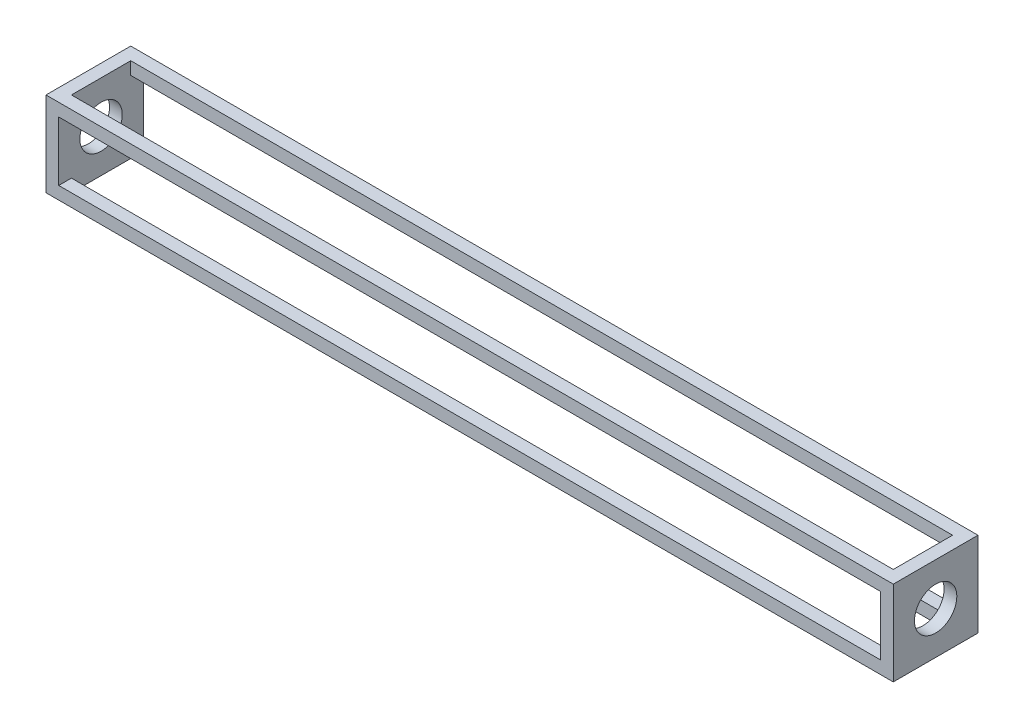
ISO-10303-21;
HEADER;
FILE_DESCRIPTION(('STEP AP214'),'2;1');
FILE_NAME('part.step','',(''),(''),'','','');
FILE_SCHEMA(('AUTOMOTIVE_DESIGN { 1 0 10303 214 1 1 1 1 }'));
ENDSEC;
DATA;
#1=APPLICATION_CONTEXT('core data for automotive mechanical design processes');
#2=APPLICATION_PROTOCOL_DEFINITION('international standard','automotive_design',2000,#1);
#3=PRODUCT_CONTEXT('',#1,'mechanical');
#4=PRODUCT('Part','Part','',(#3));
#5=PRODUCT_RELATED_PRODUCT_CATEGORY('part','',(#4));
#6=PRODUCT_DEFINITION_FORMATION('','',#4);
#7=PRODUCT_DEFINITION_CONTEXT('part definition',#1,'design');
#8=PRODUCT_DEFINITION('design','',#6,#7);
#9=PRODUCT_DEFINITION_SHAPE('','',#8);
#10=(LENGTH_UNIT() NAMED_UNIT(*) SI_UNIT(.MILLI.,.METRE.));
#11=(NAMED_UNIT(*) PLANE_ANGLE_UNIT() SI_UNIT($,.RADIAN.));
#12=(NAMED_UNIT(*) SI_UNIT($,.STERADIAN.) SOLID_ANGLE_UNIT());
#13=UNCERTAINTY_MEASURE_WITH_UNIT(LENGTH_MEASURE(1.E-05),#10,'distance_accuracy_value','');
#14=(GEOMETRIC_REPRESENTATION_CONTEXT(3) GLOBAL_UNCERTAINTY_ASSIGNED_CONTEXT((#13)) GLOBAL_UNIT_ASSIGNED_CONTEXT((#10,
#11,#12)) REPRESENTATION_CONTEXT('',''));
#15=CARTESIAN_POINT('',(0.,0.,0.));
#16=DIRECTION('',(0.,0.,1.));
#17=DIRECTION('',(1.,0.,0.));
#18=AXIS2_PLACEMENT_3D('',#15,#16,#17);
#19=CARTESIAN_POINT('',(0.,3.,20.));
#20=DIRECTION('',(0.,1.,0.));
#21=DIRECTION('',(0.,0.,1.));
#22=AXIS2_PLACEMENT_3D('',#19,#20,#21);
#23=PLANE('',#22);
#24=DIRECTION('',(1.,0.,0.));
#25=VECTOR('',#24,1.);
#26=CARTESIAN_POINT('',(0.,3.,17.));
#27=LINE('',#26,#25);
#28=CARTESIAN_POINT('',(3.,3.,17.));
#29=VERTEX_POINT('',#28);
#30=CARTESIAN_POINT('',(197.,3.,17.));
#31=VERTEX_POINT('',#30);
#32=EDGE_CURVE('E237',#29,#31,#27,.T.);
#33=ORIENTED_EDGE('',*,*,#32,.F.);
#34=DIRECTION('',(0.,0.,-1.));
#35=VECTOR('',#34,1.);
#36=CARTESIAN_POINT('',(3.,3.,20.));
#37=LINE('',#36,#35);
#38=CARTESIAN_POINT('',(3.,3.,20.));
#39=VERTEX_POINT('',#38);
#40=EDGE_CURVE('E175',#39,#29,#37,.T.);
#41=ORIENTED_EDGE('',*,*,#40,.F.);
#42=DIRECTION('',(1.,0.,0.));
#43=VECTOR('',#42,1.);
#44=CARTESIAN_POINT('',(3.,3.,20.));
#45=LINE('',#44,#43);
#46=CARTESIAN_POINT('',(197.,3.,20.));
#47=VERTEX_POINT('',#46);
#48=EDGE_CURVE('E225',#39,#47,#45,.T.);
#49=ORIENTED_EDGE('',*,*,#48,.T.);
#50=DIRECTION('',(0.,0.,-1.));
#51=VECTOR('',#50,1.);
#52=CARTESIAN_POINT('',(197.,3.,20.));
#53=LINE('',#52,#51);
#54=EDGE_CURVE('E179',#47,#31,#53,.T.);
#55=ORIENTED_EDGE('',*,*,#54,.T.);
#56=EDGE_LOOP('',(#33,#41,#49,#55));
#57=FACE_BOUND('',#56,.T.);
#58=ADVANCED_FACE('F16',(#57),#23,.T.);
#59=CARTESIAN_POINT('',(0.,17.,20.));
#60=DIRECTION('',(0.,-1.,0.));
#61=DIRECTION('',(0.,0.,-1.));
#62=AXIS2_PLACEMENT_3D('',#59,#60,#61);
#63=PLANE('',#62);
#64=DIRECTION('',(-1.,0.,0.));
#65=VECTOR('',#64,1.);
#66=CARTESIAN_POINT('',(0.,17.,17.));
#67=LINE('',#66,#65);
#68=CARTESIAN_POINT('',(197.,17.,17.));
#69=VERTEX_POINT('',#68);
#70=CARTESIAN_POINT('',(3.,17.,17.));
#71=VERTEX_POINT('',#70);
#72=EDGE_CURVE('E239',#69,#71,#67,.T.);
#73=ORIENTED_EDGE('',*,*,#72,.F.);
#74=DIRECTION('',(0.,0.,-1.));
#75=VECTOR('',#74,1.);
#76=CARTESIAN_POINT('',(197.,17.,20.));
#77=LINE('',#76,#75);
#78=CARTESIAN_POINT('',(197.,17.,20.));
#79=VERTEX_POINT('',#78);
#80=EDGE_CURVE('E165',#79,#69,#77,.T.);
#81=ORIENTED_EDGE('',*,*,#80,.F.);
#82=DIRECTION('',(-1.,0.,0.));
#83=VECTOR('',#82,1.);
#84=CARTESIAN_POINT('',(197.,17.,20.));
#85=LINE('',#84,#83);
#86=CARTESIAN_POINT('',(3.,17.,20.));
#87=VERTEX_POINT('',#86);
#88=EDGE_CURVE('E231',#79,#87,#85,.T.);
#89=ORIENTED_EDGE('',*,*,#88,.T.);
#90=DIRECTION('',(0.,0.,-1.));
#91=VECTOR('',#90,1.);
#92=CARTESIAN_POINT('',(3.,17.,20.));
#93=LINE('',#92,#91);
#94=EDGE_CURVE('E171',#87,#71,#93,.T.);
#95=ORIENTED_EDGE('',*,*,#94,.T.);
#96=EDGE_LOOP('',(#73,#81,#89,#95));
#97=FACE_BOUND('',#96,.T.);
#98=ADVANCED_FACE('F267',(#97),#63,.T.);
#99=CARTESIAN_POINT('',(0.,20.,20.));
#100=DIRECTION('',(0.,0.,-1.));
#101=DIRECTION('',(-1.,0.,0.));
#102=AXIS2_PLACEMENT_3D('',#99,#100,#101);
#103=PLANE('',#102);
#104=DIRECTION('',(0.,-1.,0.));
#105=VECTOR('',#104,1.);
#106=CARTESIAN_POINT('',(0.,0.,20.));
#107=LINE('',#106,#105);
#108=CARTESIAN_POINT('',(0.,20.,20.));
#109=VERTEX_POINT('',#108);
#110=CARTESIAN_POINT('',(0.,0.,20.));
#111=VERTEX_POINT('',#110);
#112=EDGE_CURVE('E200',#109,#111,#107,.T.);
#113=ORIENTED_EDGE('',*,*,#112,.T.);
#114=DIRECTION('',(1.,0.,0.));
#115=VECTOR('',#114,1.);
#116=CARTESIAN_POINT('',(0.,0.,20.));
#117=LINE('',#116,#115);
#118=CARTESIAN_POINT('',(200.,0.,20.));
#119=VERTEX_POINT('',#118);
#120=EDGE_CURVE('E211',#111,#119,#117,.T.);
#121=ORIENTED_EDGE('',*,*,#120,.T.);
#122=DIRECTION('',(0.,1.,0.));
#123=VECTOR('',#122,1.);
#124=CARTESIAN_POINT('',(200.,0.,20.));
#125=LINE('',#124,#123);
#126=CARTESIAN_POINT('',(200.,20.,20.));
#127=VERTEX_POINT('',#126);
#128=EDGE_CURVE('E209',#119,#127,#125,.T.);
#129=ORIENTED_EDGE('',*,*,#128,.T.);
#130=DIRECTION('',(-1.,0.,0.));
#131=VECTOR('',#130,1.);
#132=CARTESIAN_POINT('',(0.,20.,20.));
#133=LINE('',#132,#131);
#134=EDGE_CURVE('E197',#127,#109,#133,.T.);
#135=ORIENTED_EDGE('',*,*,#134,.T.);
#136=EDGE_LOOP('',(#113,#121,#129,#135));
#137=FACE_BOUND('',#136,.T.);
#138=ORIENTED_EDGE('',*,*,#88,.F.);
#139=DIRECTION('',(0.,1.,0.));
#140=VECTOR('',#139,1.);
#141=CARTESIAN_POINT('',(197.,3.,20.));
#142=LINE('',#141,#140);
#143=EDGE_CURVE('E220',#47,#79,#142,.T.);
#144=ORIENTED_EDGE('',*,*,#143,.F.);
#145=ORIENTED_EDGE('',*,*,#48,.F.);
#146=DIRECTION('',(0.,-1.,0.));
#147=VECTOR('',#146,1.);
#148=CARTESIAN_POINT('',(3.,17.,20.));
#149=LINE('',#148,#147);
#150=EDGE_CURVE('E228',#87,#39,#149,.T.);
#151=ORIENTED_EDGE('',*,*,#150,.F.);
#152=EDGE_LOOP('',(#138,#144,#145,#151));
#153=FACE_BOUND('',#152,.T.);
#154=ADVANCED_FACE('F277',(#137,#153),#103,.F.);
#155=CARTESIAN_POINT('',(0.,20.,0.));
#156=DIRECTION('',(0.,0.,-1.));
#157=DIRECTION('',(-1.,0.,0.));
#158=AXIS2_PLACEMENT_3D('',#155,#156,#157);
#159=PLANE('',#158);
#160=DIRECTION('',(0.,-1.,0.));
#161=VECTOR('',#160,1.);
#162=CARTESIAN_POINT('',(0.,0.,0.));
#163=LINE('',#162,#161);
#164=CARTESIAN_POINT('',(0.,20.,0.));
#165=VERTEX_POINT('',#164);
#166=CARTESIAN_POINT('',(0.,0.,0.));
#167=VERTEX_POINT('',#166);
#168=EDGE_CURVE('E205',#165,#167,#163,.T.);
#169=ORIENTED_EDGE('',*,*,#168,.F.);
#170=DIRECTION('',(-1.,0.,0.));
#171=VECTOR('',#170,1.);
#172=CARTESIAN_POINT('',(0.,20.,0.));
#173=LINE('',#172,#171);
#174=CARTESIAN_POINT('',(200.,20.,0.));
#175=VERTEX_POINT('',#174);
#176=EDGE_CURVE('E198',#175,#165,#173,.T.);
#177=ORIENTED_EDGE('',*,*,#176,.F.);
#178=DIRECTION('',(0.,1.,0.));
#179=VECTOR('',#178,1.);
#180=CARTESIAN_POINT('',(200.,0.,0.));
#181=LINE('',#180,#179);
#182=CARTESIAN_POINT('',(200.,0.,0.));
#183=VERTEX_POINT('',#182);
#184=EDGE_CURVE('E201',#183,#175,#181,.T.);
#185=ORIENTED_EDGE('',*,*,#184,.F.);
#186=DIRECTION('',(1.,0.,0.));
#187=VECTOR('',#186,1.);
#188=CARTESIAN_POINT('',(0.,0.,0.));
#189=LINE('',#188,#187);
#190=EDGE_CURVE('E203',#167,#183,#189,.T.);
#191=ORIENTED_EDGE('',*,*,#190,.F.);
#192=EDGE_LOOP('',(#169,#177,#185,#191));
#193=FACE_BOUND('',#192,.T.);
#194=DIRECTION('',(0.,1.,0.));
#195=VECTOR('',#194,1.);
#196=CARTESIAN_POINT('',(197.,20.,0.));
#197=LINE('',#196,#195);
#198=CARTESIAN_POINT('',(197.,3.,0.));
#199=VERTEX_POINT('',#198);
#200=CARTESIAN_POINT('',(197.,17.,0.));
#201=VERTEX_POINT('',#200);
#202=EDGE_CURVE('E162',#199,#201,#197,.T.);
#203=ORIENTED_EDGE('',*,*,#202,.T.);
#204=DIRECTION('',(-1.,0.,0.));
#205=VECTOR('',#204,1.);
#206=CARTESIAN_POINT('',(0.,17.,0.));
#207=LINE('',#206,#205);
#208=CARTESIAN_POINT('',(3.,17.,0.));
#209=VERTEX_POINT('',#208);
#210=EDGE_CURVE('E135',#201,#209,#207,.T.);
#211=ORIENTED_EDGE('',*,*,#210,.T.);
#212=DIRECTION('',(0.,-1.,0.));
#213=VECTOR('',#212,1.);
#214=CARTESIAN_POINT('',(3.,20.,0.));
#215=LINE('',#214,#213);
#216=CARTESIAN_POINT('',(3.,3.,0.));
#217=VERTEX_POINT('',#216);
#218=EDGE_CURVE('E156',#209,#217,#215,.T.);
#219=ORIENTED_EDGE('',*,*,#218,.T.);
#220=DIRECTION('',(1.,0.,0.));
#221=VECTOR('',#220,1.);
#222=CARTESIAN_POINT('',(0.,3.,0.));
#223=LINE('',#222,#221);
#224=EDGE_CURVE('E159',#217,#199,#223,.T.);
#225=ORIENTED_EDGE('',*,*,#224,.T.);
#226=EDGE_LOOP('',(#203,#211,#219,#225));
#227=FACE_BOUND('',#226,.T.);
#228=ADVANCED_FACE('F292',(#193,#227),#159,.T.);
#229=CARTESIAN_POINT('',(3.,0.,20.));
#230=DIRECTION('',(1.,0.,0.));
#231=DIRECTION('',(0.,0.,-1.));
#232=AXIS2_PLACEMENT_3D('',#229,#230,#231);
#233=PLANE('',#232);
#234=CARTESIAN_POINT('',(3.,17.,3.));
#235=VERTEX_POINT('',#234);
#236=EDGE_CURVE('E144',#235,#209,#93,.T.);
#237=ORIENTED_EDGE('',*,*,#236,.F.);
#238=DIRECTION('',(0.,-1.,0.));
#239=VECTOR('',#238,1.);
#240=CARTESIAN_POINT('',(3.,37.,3.));
#241=LINE('',#240,#239);
#242=CARTESIAN_POINT('',(3.,20.,3.));
#243=VERTEX_POINT('',#242);
#244=EDGE_CURVE('E39',#243,#235,#241,.T.);
#245=ORIENTED_EDGE('',*,*,#244,.F.);
#246=DIRECTION('',(0.,0.,-1.));
#247=VECTOR('',#246,1.);
#248=CARTESIAN_POINT('',(3.,20.,20.));
#249=LINE('',#248,#247);
#250=CARTESIAN_POINT('',(3.,20.,17.));
#251=VERTEX_POINT('',#250);
#252=EDGE_CURVE('E11',#251,#243,#249,.T.);
#253=ORIENTED_EDGE('',*,*,#252,.F.);
#254=DIRECTION('',(0.,-1.,0.));
#255=VECTOR('',#254,1.);
#256=CARTESIAN_POINT('',(3.,37.,17.));
#257=LINE('',#256,#255);
#258=EDGE_CURVE('E253',#251,#71,#257,.T.);
#259=ORIENTED_EDGE('',*,*,#258,.T.);
#260=ORIENTED_EDGE('',*,*,#94,.F.);
#261=ORIENTED_EDGE('',*,*,#150,.T.);
#262=ORIENTED_EDGE('',*,*,#40,.T.);
#263=CARTESIAN_POINT('',(3.,0.,17.));
#264=VERTEX_POINT('',#263);
#265=EDGE_CURVE('E260',#29,#264,#257,.T.);
#266=ORIENTED_EDGE('',*,*,#265,.T.);
#267=DIRECTION('',(0.,0.,1.));
#268=VECTOR('',#267,1.);
#269=CARTESIAN_POINT('',(3.,0.,20.));
#270=LINE('',#269,#268);
#271=CARTESIAN_POINT('',(3.,0.,3.));
#272=VERTEX_POINT('',#271);
#273=EDGE_CURVE('E234',#272,#264,#270,.T.);
#274=ORIENTED_EDGE('',*,*,#273,.F.);
#275=CARTESIAN_POINT('',(3.,3.,3.));
#276=VERTEX_POINT('',#275);
#277=EDGE_CURVE('E145',#276,#272,#241,.T.);
#278=ORIENTED_EDGE('',*,*,#277,.F.);
#279=EDGE_CURVE('E174',#276,#217,#37,.T.);
#280=ORIENTED_EDGE('',*,*,#279,.T.);
#281=ORIENTED_EDGE('',*,*,#218,.F.);
#282=EDGE_LOOP('',(#237,#245,#253,#259,#260,#261,#262,#266,#274,#278,#280,#281));
#283=FACE_BOUND('',#282,.T.);
#284=CARTESIAN_POINT('',(3.,10.,10.));
#285=DIRECTION('',(1.,0.,0.));
#286=DIRECTION('',(0.,0.,-1.));
#287=AXIS2_PLACEMENT_3D('',#284,#285,#286);
#288=CIRCLE('',#287,5.);
#289=CARTESIAN_POINT('',(3.,10.,5.));
#290=VERTEX_POINT('',#289);
#291=EDGE_CURVE('E169',#290,#290,#288,.T.);
#292=ORIENTED_EDGE('',*,*,#291,.F.);
#293=EDGE_LOOP('',(#292));
#294=FACE_BOUND('',#293,.T.);
#295=ADVANCED_FACE('F139',(#283,#294),#233,.T.);
#296=DIRECTION('',(-1.,0.,0.));
#297=VECTOR('',#296,1.);
#298=CARTESIAN_POINT('',(0.,3.,3.));
#299=LINE('',#298,#297);
#300=CARTESIAN_POINT('',(197.,3.,3.));
#301=VERTEX_POINT('',#300);
#302=EDGE_CURVE('E247',#301,#276,#299,.T.);
#303=ORIENTED_EDGE('',*,*,#302,.F.);
#304=EDGE_CURVE('E178',#301,#199,#53,.T.);
#305=ORIENTED_EDGE('',*,*,#304,.T.);
#306=ORIENTED_EDGE('',*,*,#224,.F.);
#307=ORIENTED_EDGE('',*,*,#279,.F.);
#308=EDGE_LOOP('',(#303,#305,#306,#307));
#309=FACE_BOUND('',#308,.T.);
#310=ADVANCED_FACE('F289',(#309),#23,.T.);
#311=CARTESIAN_POINT('',(197.,0.,20.));
#312=DIRECTION('',(-1.,0.,0.));
#313=DIRECTION('',(0.,0.,1.));
#314=AXIS2_PLACEMENT_3D('',#311,#312,#313);
#315=PLANE('',#314);
#316=ORIENTED_EDGE('',*,*,#304,.F.);
#317=DIRECTION('',(0.,-1.,0.));
#318=VECTOR('',#317,1.);
#319=CARTESIAN_POINT('',(197.,37.,3.));
#320=LINE('',#319,#318);
#321=CARTESIAN_POINT('',(197.,0.,3.));
#322=VERTEX_POINT('',#321);
#323=EDGE_CURVE('E31',#301,#322,#320,.T.);
#324=ORIENTED_EDGE('',*,*,#323,.T.);
#325=DIRECTION('',(0.,0.,-1.));
#326=VECTOR('',#325,1.);
#327=CARTESIAN_POINT('',(197.,0.,20.));
#328=LINE('',#327,#326);
#329=CARTESIAN_POINT('',(197.,0.,17.));
#330=VERTEX_POINT('',#329);
#331=EDGE_CURVE('E244',#330,#322,#328,.T.);
#332=ORIENTED_EDGE('',*,*,#331,.F.);
#333=DIRECTION('',(0.,-1.,0.));
#334=VECTOR('',#333,1.);
#335=CARTESIAN_POINT('',(197.,37.,17.));
#336=LINE('',#335,#334);
#337=EDGE_CURVE('E256',#31,#330,#336,.T.);
#338=ORIENTED_EDGE('',*,*,#337,.F.);
#339=ORIENTED_EDGE('',*,*,#54,.F.);
#340=ORIENTED_EDGE('',*,*,#143,.T.);
#341=ORIENTED_EDGE('',*,*,#80,.T.);
#342=CARTESIAN_POINT('',(197.,20.,17.));
#343=VERTEX_POINT('',#342);
#344=EDGE_CURVE('E259',#343,#69,#336,.T.);
#345=ORIENTED_EDGE('',*,*,#344,.F.);
#346=DIRECTION('',(0.,0.,1.));
#347=VECTOR('',#346,1.);
#348=CARTESIAN_POINT('',(197.,20.,20.));
#349=LINE('',#348,#347);
#350=CARTESIAN_POINT('',(197.,20.,3.));
#351=VERTEX_POINT('',#350);
#352=EDGE_CURVE('E134',#351,#343,#349,.T.);
#353=ORIENTED_EDGE('',*,*,#352,.F.);
#354=CARTESIAN_POINT('',(197.,17.,3.));
#355=VERTEX_POINT('',#354);
#356=EDGE_CURVE('E130',#351,#355,#320,.T.);
#357=ORIENTED_EDGE('',*,*,#356,.T.);
#358=EDGE_CURVE('E182',#355,#201,#77,.T.);
#359=ORIENTED_EDGE('',*,*,#358,.T.);
#360=ORIENTED_EDGE('',*,*,#202,.F.);
#361=EDGE_LOOP('',(#316,#324,#332,#338,#339,#340,#341,#345,#353,#357,#359,#360));
#362=FACE_BOUND('',#361,.T.);
#363=CARTESIAN_POINT('',(197.,10.,10.));
#364=DIRECTION('',(-1.,0.,0.));
#365=DIRECTION('',(0.,0.,1.));
#366=AXIS2_PLACEMENT_3D('',#363,#364,#365);
#367=CIRCLE('',#366,5.);
#368=CARTESIAN_POINT('',(197.,10.,15.));
#369=VERTEX_POINT('',#368);
#370=EDGE_CURVE('E166',#369,#369,#367,.T.);
#371=ORIENTED_EDGE('',*,*,#370,.F.);
#372=EDGE_LOOP('',(#371));
#373=FACE_BOUND('',#372,.T.);
#374=ADVANCED_FACE('F269',(#362,#373),#315,.T.);
#375=DIRECTION('',(1.,0.,0.));
#376=VECTOR('',#375,1.);
#377=CARTESIAN_POINT('',(0.,17.,3.));
#378=LINE('',#377,#376);
#379=EDGE_CURVE('E249',#235,#355,#378,.T.);
#380=ORIENTED_EDGE('',*,*,#379,.F.);
#381=ORIENTED_EDGE('',*,*,#236,.T.);
#382=ORIENTED_EDGE('',*,*,#210,.F.);
#383=ORIENTED_EDGE('',*,*,#358,.F.);
#384=EDGE_LOOP('',(#380,#381,#382,#383));
#385=FACE_BOUND('',#384,.T.);
#386=ADVANCED_FACE('F18',(#385),#63,.T.);
#387=CARTESIAN_POINT('',(0.,10.,10.));
#388=DIRECTION('',(1.,0.,0.));
#389=DIRECTION('',(0.,0.,-1.));
#390=AXIS2_PLACEMENT_3D('',#387,#388,#389);
#391=CYLINDRICAL_SURFACE('',#390,5.);
#392=ORIENTED_EDGE('',*,*,#370,.T.);
#393=EDGE_LOOP('',(#392));
#394=FACE_BOUND('',#393,.T.);
#395=CARTESIAN_POINT('',(200.,10.,10.));
#396=DIRECTION('',(1.,0.,0.));
#397=DIRECTION('',(0.,0.,-1.));
#398=AXIS2_PLACEMENT_3D('',#395,#396,#397);
#399=CIRCLE('',#398,5.);
#400=CARTESIAN_POINT('',(200.,10.,5.));
#401=VERTEX_POINT('',#400);
#402=EDGE_CURVE('E217',#401,#401,#399,.T.);
#403=ORIENTED_EDGE('',*,*,#402,.T.);
#404=EDGE_LOOP('',(#403));
#405=FACE_BOUND('',#404,.T.);
#406=ADVANCED_FACE('F297',(#394,#405),#391,.F.);
#407=ORIENTED_EDGE('',*,*,#291,.T.);
#408=EDGE_LOOP('',(#407));
#409=FACE_BOUND('',#408,.T.);
#410=CARTESIAN_POINT('',(0.,10.,10.));
#411=DIRECTION('',(1.,0.,0.));
#412=DIRECTION('',(0.,0.,-1.));
#413=AXIS2_PLACEMENT_3D('',#410,#411,#412);
#414=CIRCLE('',#413,5.);
#415=CARTESIAN_POINT('',(0.,10.,5.));
#416=VERTEX_POINT('',#415);
#417=EDGE_CURVE('E170',#416,#416,#414,.T.);
#418=ORIENTED_EDGE('',*,*,#417,.F.);
#419=EDGE_LOOP('',(#418));
#420=FACE_BOUND('',#419,.T.);
#421=ADVANCED_FACE('F304',(#409,#420),#391,.F.);
#422=CARTESIAN_POINT('',(0.,0.,20.));
#423=DIRECTION('',(1.,0.,0.));
#424=DIRECTION('',(0.,0.,-1.));
#425=AXIS2_PLACEMENT_3D('',#422,#423,#424);
#426=PLANE('',#425);
#427=ORIENTED_EDGE('',*,*,#417,.T.);
#428=EDGE_LOOP('',(#427));
#429=FACE_BOUND('',#428,.T.);
#430=ORIENTED_EDGE('',*,*,#168,.T.);
#431=DIRECTION('',(0.,0.,-1.));
#432=VECTOR('',#431,1.);
#433=CARTESIAN_POINT('',(0.,0.,20.));
#434=LINE('',#433,#432);
#435=EDGE_CURVE('E185',#111,#167,#434,.T.);
#436=ORIENTED_EDGE('',*,*,#435,.F.);
#437=ORIENTED_EDGE('',*,*,#112,.F.);
#438=DIRECTION('',(0.,0.,-1.));
#439=VECTOR('',#438,1.);
#440=CARTESIAN_POINT('',(0.,20.,20.));
#441=LINE('',#440,#439);
#442=EDGE_CURVE('E194',#109,#165,#441,.T.);
#443=ORIENTED_EDGE('',*,*,#442,.T.);
#444=EDGE_LOOP('',(#430,#436,#437,#443));
#445=FACE_BOUND('',#444,.T.);
#446=ADVANCED_FACE('F326',(#429,#445),#426,.F.);
#447=CARTESIAN_POINT('',(0.,0.,20.));
#448=DIRECTION('',(0.,1.,0.));
#449=DIRECTION('',(0.,0.,1.));
#450=AXIS2_PLACEMENT_3D('',#447,#448,#449);
#451=PLANE('',#450);
#452=DIRECTION('',(-1.,0.,0.));
#453=VECTOR('',#452,1.);
#454=CARTESIAN_POINT('',(0.,0.,3.));
#455=LINE('',#454,#453);
#456=EDGE_CURVE('E251',#322,#272,#455,.T.);
#457=ORIENTED_EDGE('',*,*,#456,.T.);
#458=ORIENTED_EDGE('',*,*,#273,.T.);
#459=DIRECTION('',(1.,0.,0.));
#460=VECTOR('',#459,1.);
#461=CARTESIAN_POINT('',(0.,0.,17.));
#462=LINE('',#461,#460);
#463=EDGE_CURVE('E241',#264,#330,#462,.T.);
#464=ORIENTED_EDGE('',*,*,#463,.T.);
#465=ORIENTED_EDGE('',*,*,#331,.T.);
#466=EDGE_LOOP('',(#457,#458,#464,#465));
#467=FACE_BOUND('',#466,.T.);
#468=ORIENTED_EDGE('',*,*,#190,.T.);
#469=DIRECTION('',(0.,0.,-1.));
#470=VECTOR('',#469,1.);
#471=CARTESIAN_POINT('',(200.,0.,20.));
#472=LINE('',#471,#470);
#473=EDGE_CURVE('E188',#119,#183,#472,.T.);
#474=ORIENTED_EDGE('',*,*,#473,.F.);
#475=ORIENTED_EDGE('',*,*,#120,.F.);
#476=ORIENTED_EDGE('',*,*,#435,.T.);
#477=EDGE_LOOP('',(#468,#474,#475,#476));
#478=FACE_BOUND('',#477,.T.);
#479=ADVANCED_FACE('F283',(#467,#478),#451,.F.);
#480=CARTESIAN_POINT('',(200.,0.,20.));
#481=DIRECTION('',(-1.,0.,0.));
#482=DIRECTION('',(0.,0.,1.));
#483=AXIS2_PLACEMENT_3D('',#480,#481,#482);
#484=PLANE('',#483);
#485=ORIENTED_EDGE('',*,*,#402,.F.);
#486=EDGE_LOOP('',(#485));
#487=FACE_BOUND('',#486,.T.);
#488=ORIENTED_EDGE('',*,*,#184,.T.);
#489=DIRECTION('',(0.,0.,-1.));
#490=VECTOR('',#489,1.);
#491=CARTESIAN_POINT('',(200.,20.,20.));
#492=LINE('',#491,#490);
#493=EDGE_CURVE('E191',#127,#175,#492,.T.);
#494=ORIENTED_EDGE('',*,*,#493,.F.);
#495=ORIENTED_EDGE('',*,*,#128,.F.);
#496=ORIENTED_EDGE('',*,*,#473,.T.);
#497=EDGE_LOOP('',(#488,#494,#495,#496));
#498=FACE_BOUND('',#497,.T.);
#499=ADVANCED_FACE('F332',(#487,#498),#484,.F.);
#500=CARTESIAN_POINT('',(0.,20.,20.));
#501=DIRECTION('',(0.,-1.,0.));
#502=DIRECTION('',(0.,0.,-1.));
#503=AXIS2_PLACEMENT_3D('',#500,#501,#502);
#504=PLANE('',#503);
#505=DIRECTION('',(-1.,0.,0.));
#506=VECTOR('',#505,1.);
#507=CARTESIAN_POINT('',(0.,20.,17.));
#508=LINE('',#507,#506);
#509=EDGE_CURVE('E24',#343,#251,#508,.T.);
#510=ORIENTED_EDGE('',*,*,#509,.T.);
#511=ORIENTED_EDGE('',*,*,#252,.T.);
#512=DIRECTION('',(1.,0.,0.));
#513=VECTOR('',#512,1.);
#514=CARTESIAN_POINT('',(0.,20.,3.));
#515=LINE('',#514,#513);
#516=EDGE_CURVE('E127',#243,#351,#515,.T.);
#517=ORIENTED_EDGE('',*,*,#516,.T.);
#518=ORIENTED_EDGE('',*,*,#352,.T.);
#519=EDGE_LOOP('',(#510,#511,#517,#518));
#520=FACE_BOUND('',#519,.T.);
#521=ORIENTED_EDGE('',*,*,#176,.T.);
#522=ORIENTED_EDGE('',*,*,#442,.F.);
#523=ORIENTED_EDGE('',*,*,#134,.F.);
#524=ORIENTED_EDGE('',*,*,#493,.T.);
#525=EDGE_LOOP('',(#521,#522,#523,#524));
#526=FACE_BOUND('',#525,.T.);
#527=ADVANCED_FACE('F148',(#520,#526),#504,.F.);
#528=CARTESIAN_POINT('',(3.,37.,3.));
#529=DIRECTION('',(0.,0.,-1.));
#530=DIRECTION('',(-1.,0.,0.));
#531=AXIS2_PLACEMENT_3D('',#528,#529,#530);
#532=PLANE('',#531);
#533=ORIENTED_EDGE('',*,*,#379,.T.);
#534=ORIENTED_EDGE('',*,*,#356,.F.);
#535=ORIENTED_EDGE('',*,*,#516,.F.);
#536=ORIENTED_EDGE('',*,*,#244,.T.);
#537=EDGE_LOOP('',(#533,#534,#535,#536));
#538=FACE_BOUND('',#537,.T.);
#539=ADVANCED_FACE('F128',(#538),#532,.F.);
#540=CARTESIAN_POINT('',(197.,37.,17.));
#541=DIRECTION('',(0.,0.,1.));
#542=DIRECTION('',(1.,0.,0.));
#543=AXIS2_PLACEMENT_3D('',#540,#541,#542);
#544=PLANE('',#543);
#545=ORIENTED_EDGE('',*,*,#72,.T.);
#546=ORIENTED_EDGE('',*,*,#258,.F.);
#547=ORIENTED_EDGE('',*,*,#509,.F.);
#548=ORIENTED_EDGE('',*,*,#344,.T.);
#549=EDGE_LOOP('',(#545,#546,#547,#548));
#550=FACE_BOUND('',#549,.T.);
#551=ADVANCED_FACE('F264',(#550),#544,.F.);
#552=ORIENTED_EDGE('',*,*,#32,.T.);
#553=ORIENTED_EDGE('',*,*,#337,.T.);
#554=ORIENTED_EDGE('',*,*,#463,.F.);
#555=ORIENTED_EDGE('',*,*,#265,.F.);
#556=EDGE_LOOP('',(#552,#553,#554,#555));
#557=FACE_BOUND('',#556,.T.);
#558=ADVANCED_FACE('F281',(#557),#544,.F.);
#559=ORIENTED_EDGE('',*,*,#302,.T.);
#560=ORIENTED_EDGE('',*,*,#277,.T.);
#561=ORIENTED_EDGE('',*,*,#456,.F.);
#562=ORIENTED_EDGE('',*,*,#323,.F.);
#563=EDGE_LOOP('',(#559,#560,#561,#562));
#564=FACE_BOUND('',#563,.T.);
#565=ADVANCED_FACE('F341',(#564),#532,.F.);
#566=CLOSED_SHELL('',(#58,#98,#154,#228,#295,#310,#374,#386,#406,#421,#446,#479,#499,#527,#539,
#551,#558,#565));
#567=MANIFOLD_SOLID_BREP('B1',#566);
#568=ADVANCED_BREP_SHAPE_REPRESENTATION('',(#18,#567),#14);
#569=SHAPE_DEFINITION_REPRESENTATION(#9,#568);
ENDSEC;
END-ISO-10303-21;
